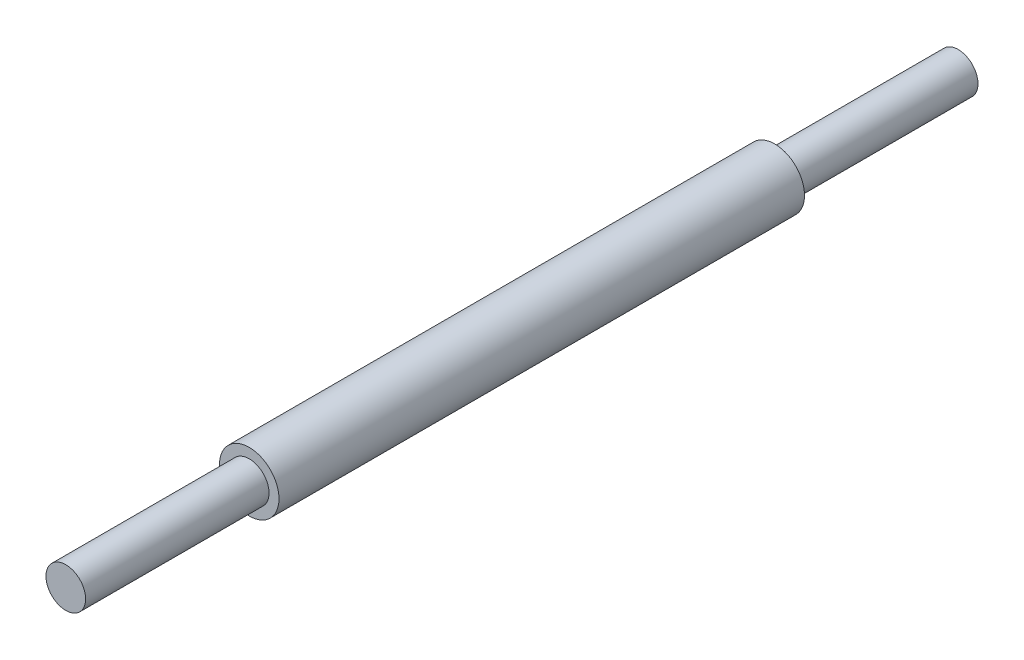
ISO-10303-21;
HEADER;
FILE_DESCRIPTION(('STEP AP214'),'2;1');
FILE_NAME('part.step','',(''),(''),'','','');
FILE_SCHEMA(('AUTOMOTIVE_DESIGN { 1 0 10303 214 1 1 1 1 }'));
ENDSEC;
DATA;
#1=APPLICATION_CONTEXT('core data for automotive mechanical design processes');
#2=APPLICATION_PROTOCOL_DEFINITION('international standard','automotive_design',2000,#1);
#3=PRODUCT_CONTEXT('',#1,'mechanical');
#4=PRODUCT('Part','Part','',(#3));
#5=PRODUCT_RELATED_PRODUCT_CATEGORY('part','',(#4));
#6=PRODUCT_DEFINITION_FORMATION('','',#4);
#7=PRODUCT_DEFINITION_CONTEXT('part definition',#1,'design');
#8=PRODUCT_DEFINITION('design','',#6,#7);
#9=PRODUCT_DEFINITION_SHAPE('','',#8);
#10=(LENGTH_UNIT() NAMED_UNIT(*) SI_UNIT(.MILLI.,.METRE.));
#11=(NAMED_UNIT(*) PLANE_ANGLE_UNIT() SI_UNIT($,.RADIAN.));
#12=(NAMED_UNIT(*) SI_UNIT($,.STERADIAN.) SOLID_ANGLE_UNIT());
#13=UNCERTAINTY_MEASURE_WITH_UNIT(LENGTH_MEASURE(1.E-05),#10,'distance_accuracy_value','');
#14=(GEOMETRIC_REPRESENTATION_CONTEXT(3) GLOBAL_UNCERTAINTY_ASSIGNED_CONTEXT((#13)) GLOBAL_UNIT_ASSIGNED_CONTEXT((#10,
#11,#12)) REPRESENTATION_CONTEXT('',''));
#15=CARTESIAN_POINT('',(0.,0.,0.));
#16=DIRECTION('',(0.,0.,1.));
#17=DIRECTION('',(1.,0.,0.));
#18=AXIS2_PLACEMENT_3D('',#15,#16,#17);
#19=CARTESIAN_POINT('',(0.,0.,13.25));
#20=DIRECTION('',(0.,0.,-1.));
#21=DIRECTION('',(-1.,0.,0.));
#22=AXIS2_PLACEMENT_3D('',#19,#20,#21);
#23=CYLINDRICAL_SURFACE('',#22,1.5);
#24=CARTESIAN_POINT('',(0.,0.,13.25));
#25=DIRECTION('',(0.,0.,1.));
#26=DIRECTION('',(1.,0.,0.));
#27=AXIS2_PLACEMENT_3D('',#24,#25,#26);
#28=CIRCLE('',#27,1.5);
#29=CARTESIAN_POINT('',(1.5,0.,13.25));
#30=VERTEX_POINT('',#29);
#31=EDGE_CURVE('E39',#30,#30,#28,.T.);
#32=ORIENTED_EDGE('',*,*,#31,.F.);
#33=EDGE_LOOP('',(#32));
#34=FACE_BOUND('',#33,.T.);
#35=CARTESIAN_POINT('',(0.,0.,-13.25));
#36=DIRECTION('',(0.,0.,1.));
#37=DIRECTION('',(1.,0.,0.));
#38=AXIS2_PLACEMENT_3D('',#35,#36,#37);
#39=CIRCLE('',#38,1.5);
#40=CARTESIAN_POINT('',(1.5,0.,-13.25));
#41=VERTEX_POINT('',#40);
#42=EDGE_CURVE('E43',#41,#41,#39,.T.);
#43=ORIENTED_EDGE('',*,*,#42,.T.);
#44=EDGE_LOOP('',(#43));
#45=FACE_BOUND('',#44,.T.);
#46=ADVANCED_FACE('F33',(#34,#45),#23,.T.);
#47=CARTESIAN_POINT('',(0.,0.,13.25));
#48=DIRECTION('',(0.,0.,1.));
#49=DIRECTION('',(1.,0.,0.));
#50=AXIS2_PLACEMENT_3D('',#47,#48,#49);
#51=PLANE('',#50);
#52=CARTESIAN_POINT('',(0.,0.,13.25));
#53=DIRECTION('',(0.,0.,1.));
#54=DIRECTION('',(1.,0.,0.));
#55=AXIS2_PLACEMENT_3D('',#52,#53,#54);
#56=CIRCLE('',#55,0.999999999999999);
#57=CARTESIAN_POINT('',(0.999999999999999,0.,13.25));
#58=VERTEX_POINT('',#57);
#59=EDGE_CURVE('E48',#58,#58,#56,.F.);
#60=ORIENTED_EDGE('',*,*,#59,.T.);
#61=EDGE_LOOP('',(#60));
#62=FACE_BOUND('',#61,.T.);
#63=ORIENTED_EDGE('',*,*,#31,.T.);
#64=EDGE_LOOP('',(#63));
#65=FACE_BOUND('',#64,.T.);
#66=ADVANCED_FACE('F77',(#62,#65),#51,.T.);
#67=CARTESIAN_POINT('',(0.,0.,-13.25));
#68=DIRECTION('',(0.,0.,1.));
#69=DIRECTION('',(1.,0.,0.));
#70=AXIS2_PLACEMENT_3D('',#67,#68,#69);
#71=PLANE('',#70);
#72=CARTESIAN_POINT('',(0.,0.,-13.25));
#73=DIRECTION('',(0.,0.,1.));
#74=DIRECTION('',(1.,0.,0.));
#75=AXIS2_PLACEMENT_3D('',#72,#73,#74);
#76=CIRCLE('',#75,0.999999999999999);
#77=CARTESIAN_POINT('',(0.999999999999999,0.,-13.25));
#78=VERTEX_POINT('',#77);
#79=EDGE_CURVE('E10',#78,#78,#76,.F.);
#80=ORIENTED_EDGE('',*,*,#79,.F.);
#81=EDGE_LOOP('',(#80));
#82=FACE_BOUND('',#81,.T.);
#83=ORIENTED_EDGE('',*,*,#42,.F.);
#84=EDGE_LOOP('',(#83));
#85=FACE_BOUND('',#84,.T.);
#86=ADVANCED_FACE('F82',(#82,#85),#71,.F.);
#87=CARTESIAN_POINT('',(0.,0.,-22.5));
#88=DIRECTION('',(0.,0.,1.));
#89=DIRECTION('',(1.,0.,0.));
#90=AXIS2_PLACEMENT_3D('',#87,#88,#89);
#91=PLANE('',#90);
#92=CARTESIAN_POINT('',(0.,0.,-22.5));
#93=DIRECTION('',(0.,0.,1.));
#94=DIRECTION('',(1.,0.,0.));
#95=AXIS2_PLACEMENT_3D('',#92,#93,#94);
#96=CIRCLE('',#95,0.999999999999999);
#97=CARTESIAN_POINT('',(0.999999999999999,0.,-22.5));
#98=VERTEX_POINT('',#97);
#99=EDGE_CURVE('E53',#98,#98,#96,.T.);
#100=ORIENTED_EDGE('',*,*,#99,.F.);
#101=EDGE_LOOP('',(#100));
#102=FACE_BOUND('',#101,.T.);
#103=ADVANCED_FACE('F71',(#102),#91,.F.);
#104=CARTESIAN_POINT('',(0.,0.,22.5));
#105=DIRECTION('',(0.,0.,-1.));
#106=DIRECTION('',(-1.,0.,0.));
#107=AXIS2_PLACEMENT_3D('',#104,#105,#106);
#108=CYLINDRICAL_SURFACE('',#107,0.999999999999999);
#109=ORIENTED_EDGE('',*,*,#99,.T.);
#110=EDGE_LOOP('',(#109));
#111=FACE_BOUND('',#110,.T.);
#112=ORIENTED_EDGE('',*,*,#79,.T.);
#113=EDGE_LOOP('',(#112));
#114=FACE_BOUND('',#113,.T.);
#115=ADVANCED_FACE('F63',(#111,#114),#108,.T.);
#116=ORIENTED_EDGE('',*,*,#59,.F.);
#117=EDGE_LOOP('',(#116));
#118=FACE_BOUND('',#117,.T.);
#119=CARTESIAN_POINT('',(0.,0.,22.5));
#120=DIRECTION('',(0.,0.,1.));
#121=DIRECTION('',(1.,0.,0.));
#122=AXIS2_PLACEMENT_3D('',#119,#120,#121);
#123=CIRCLE('',#122,0.999999999999999);
#124=CARTESIAN_POINT('',(0.999999999999999,0.,22.5));
#125=VERTEX_POINT('',#124);
#126=EDGE_CURVE('E52',#125,#125,#123,.T.);
#127=ORIENTED_EDGE('',*,*,#126,.F.);
#128=EDGE_LOOP('',(#127));
#129=FACE_BOUND('',#128,.T.);
#130=ADVANCED_FACE('F61',(#118,#129),#108,.T.);
#131=CARTESIAN_POINT('',(0.,0.,22.5));
#132=DIRECTION('',(0.,0.,1.));
#133=DIRECTION('',(1.,0.,0.));
#134=AXIS2_PLACEMENT_3D('',#131,#132,#133);
#135=PLANE('',#134);
#136=ORIENTED_EDGE('',*,*,#126,.T.);
#137=EDGE_LOOP('',(#136));
#138=FACE_BOUND('',#137,.T.);
#139=ADVANCED_FACE('F59',(#138),#135,.T.);
#140=CLOSED_SHELL('',(#46,#66,#86,#103,#115,#130,#139));
#141=MANIFOLD_SOLID_BREP('B2',#140);
#142=ADVANCED_BREP_SHAPE_REPRESENTATION('',(#18,#141),#14);
#143=SHAPE_DEFINITION_REPRESENTATION(#9,#142);
ENDSEC;
END-ISO-10303-21;
